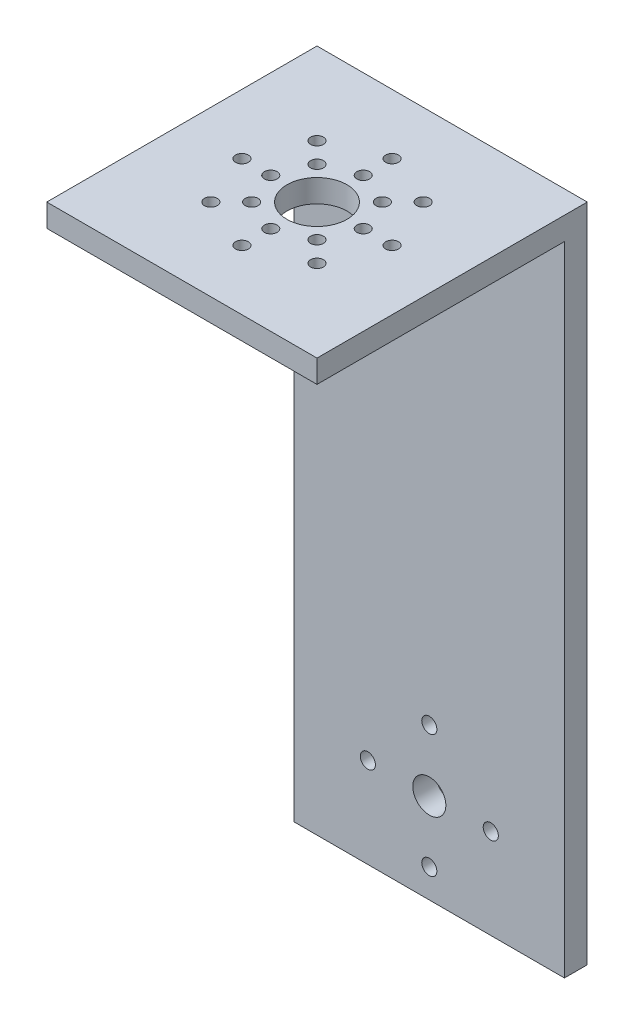
ISO-10303-21;
HEADER;
FILE_DESCRIPTION(('STEP AP214'),'2;1');
FILE_NAME('part.step','',(''),(''),'','','');
FILE_SCHEMA(('AUTOMOTIVE_DESIGN { 1 0 10303 214 1 1 1 1 }'));
ENDSEC;
DATA;
#1=APPLICATION_CONTEXT('core data for automotive mechanical design processes');
#2=APPLICATION_PROTOCOL_DEFINITION('international standard','automotive_design',2000,#1);
#3=PRODUCT_CONTEXT('',#1,'mechanical');
#4=PRODUCT('Part','Part','',(#3));
#5=PRODUCT_RELATED_PRODUCT_CATEGORY('part','',(#4));
#6=PRODUCT_DEFINITION_FORMATION('','',#4);
#7=PRODUCT_DEFINITION_CONTEXT('part definition',#1,'design');
#8=PRODUCT_DEFINITION('design','',#6,#7);
#9=PRODUCT_DEFINITION_SHAPE('','',#8);
#10=(LENGTH_UNIT() NAMED_UNIT(*) SI_UNIT(.MILLI.,.METRE.));
#11=(NAMED_UNIT(*) PLANE_ANGLE_UNIT() SI_UNIT($,.RADIAN.));
#12=(NAMED_UNIT(*) SI_UNIT($,.STERADIAN.) SOLID_ANGLE_UNIT());
#13=UNCERTAINTY_MEASURE_WITH_UNIT(LENGTH_MEASURE(1.E-05),#10,'distance_accuracy_value','');
#14=(GEOMETRIC_REPRESENTATION_CONTEXT(3) GLOBAL_UNCERTAINTY_ASSIGNED_CONTEXT((#13)) GLOBAL_UNIT_ASSIGNED_CONTEXT((#10,
#11,#12)) REPRESENTATION_CONTEXT('',''));
#15=CARTESIAN_POINT('',(0.,0.,0.));
#16=DIRECTION('',(0.,0.,1.));
#17=DIRECTION('',(1.,0.,0.));
#18=AXIS2_PLACEMENT_3D('',#15,#16,#17);
#19=CARTESIAN_POINT('',(57.15,0.,-52.324));
#20=DIRECTION('',(0.,0.,-1.));
#21=DIRECTION('',(0.,1.,0.));
#22=AXIS2_PLACEMENT_3D('',#19,#20,#21);
#23=PLANE('',#22);
#24=CARTESIAN_POINT('',(41.575,-120.65,-52.324));
#25=DIRECTION('',(0.,0.,-1.));
#26=DIRECTION('',(1.,0.,0.));
#27=AXIS2_PLACEMENT_3D('',#24,#25,#26);
#28=CIRCLE('',#27,1.6);
#29=CARTESIAN_POINT('',(43.175,-120.65,-52.324));
#30=VERTEX_POINT('',#29);
#31=EDGE_CURVE('E164',#30,#30,#28,.T.);
#32=ORIENTED_EDGE('',*,*,#31,.T.);
#33=EDGE_LOOP('',(#32));
#34=FACE_BOUND('',#33,.T.);
#35=CARTESIAN_POINT('',(28.575,-133.65,-52.324));
#36=DIRECTION('',(0.,0.,-1.));
#37=DIRECTION('',(0.,-1.,0.));
#38=AXIS2_PLACEMENT_3D('',#35,#36,#37);
#39=CIRCLE('',#38,1.6);
#40=CARTESIAN_POINT('',(28.575,-135.25,-52.324));
#41=VERTEX_POINT('',#40);
#42=EDGE_CURVE('E168',#41,#41,#39,.T.);
#43=ORIENTED_EDGE('',*,*,#42,.T.);
#44=EDGE_LOOP('',(#43));
#45=FACE_BOUND('',#44,.T.);
#46=CARTESIAN_POINT('',(15.575,-120.65,-52.324));
#47=DIRECTION('',(0.,0.,-1.));
#48=DIRECTION('',(-1.,0.,0.));
#49=AXIS2_PLACEMENT_3D('',#46,#47,#48);
#50=CIRCLE('',#49,1.6);
#51=CARTESIAN_POINT('',(13.975,-120.65,-52.324));
#52=VERTEX_POINT('',#51);
#53=EDGE_CURVE('E172',#52,#52,#50,.T.);
#54=ORIENTED_EDGE('',*,*,#53,.T.);
#55=EDGE_LOOP('',(#54));
#56=FACE_BOUND('',#55,.T.);
#57=CARTESIAN_POINT('',(28.575,-107.65,-52.324));
#58=DIRECTION('',(0.,0.,-1.));
#59=DIRECTION('',(0.,1.,0.));
#60=AXIS2_PLACEMENT_3D('',#57,#58,#59);
#61=CIRCLE('',#60,1.6);
#62=CARTESIAN_POINT('',(28.575,-106.05,-52.324));
#63=VERTEX_POINT('',#62);
#64=EDGE_CURVE('E176',#63,#63,#61,.T.);
#65=ORIENTED_EDGE('',*,*,#64,.T.);
#66=EDGE_LOOP('',(#65));
#67=FACE_BOUND('',#66,.T.);
#68=CARTESIAN_POINT('',(28.575,-120.65,-52.324));
#69=DIRECTION('',(0.,0.,-1.));
#70=DIRECTION('',(0.,1.,0.));
#71=AXIS2_PLACEMENT_3D('',#68,#69,#70);
#72=CIRCLE('',#71,3.5);
#73=CARTESIAN_POINT('',(28.575,-117.15,-52.324));
#74=VERTEX_POINT('',#73);
#75=EDGE_CURVE('E179',#74,#74,#72,.F.);
#76=ORIENTED_EDGE('',*,*,#75,.F.);
#77=EDGE_LOOP('',(#76));
#78=FACE_BOUND('',#77,.T.);
#79=DIRECTION('',(0.,-1.,0.));
#80=VECTOR('',#79,1.);
#81=CARTESIAN_POINT('',(0.,0.,-52.324));
#82=LINE('',#81,#80);
#83=CARTESIAN_POINT('',(0.,-4.826,-52.324));
#84=VERTEX_POINT('',#83);
#85=CARTESIAN_POINT('',(0.,-139.7,-52.324));
#86=VERTEX_POINT('',#85);
#87=EDGE_CURVE('E116',#84,#86,#82,.T.);
#88=ORIENTED_EDGE('',*,*,#87,.T.);
#89=DIRECTION('',(-1.,0.,0.));
#90=VECTOR('',#89,1.);
#91=CARTESIAN_POINT('',(57.15,-139.7,-52.324));
#92=LINE('',#91,#90);
#93=CARTESIAN_POINT('',(57.15,-139.7,-52.324));
#94=VERTEX_POINT('',#93);
#95=EDGE_CURVE('E11',#94,#86,#92,.T.);
#96=ORIENTED_EDGE('',*,*,#95,.F.);
#97=DIRECTION('',(0.,-1.,0.));
#98=VECTOR('',#97,1.);
#99=CARTESIAN_POINT('',(57.15,0.,-52.324));
#100=LINE('',#99,#98);
#101=CARTESIAN_POINT('',(57.15,-4.826,-52.324));
#102=VERTEX_POINT('',#101);
#103=EDGE_CURVE('E81',#102,#94,#100,.T.);
#104=ORIENTED_EDGE('',*,*,#103,.F.);
#105=DIRECTION('',(-1.,0.,0.));
#106=VECTOR('',#105,1.);
#107=CARTESIAN_POINT('',(57.15,-4.826,-52.324));
#108=LINE('',#107,#106);
#109=EDGE_CURVE('E112',#102,#84,#108,.T.);
#110=ORIENTED_EDGE('',*,*,#109,.T.);
#111=EDGE_LOOP('',(#88,#96,#104,#110));
#112=FACE_BOUND('',#111,.T.);
#113=ADVANCED_FACE('F35',(#34,#45,#56,#67,#78,#112),#23,.F.);
#114=CARTESIAN_POINT('',(57.15,-139.7,-57.15));
#115=DIRECTION('',(0.,-1.,0.));
#116=DIRECTION('',(0.,0.,-1.));
#117=AXIS2_PLACEMENT_3D('',#114,#115,#116);
#118=PLANE('',#117);
#119=DIRECTION('',(0.,0.,1.));
#120=VECTOR('',#119,1.);
#121=CARTESIAN_POINT('',(0.,-139.7,-57.15));
#122=LINE('',#121,#120);
#123=CARTESIAN_POINT('',(0.,-139.7,-57.15));
#124=VERTEX_POINT('',#123);
#125=EDGE_CURVE('E119',#124,#86,#122,.T.);
#126=ORIENTED_EDGE('',*,*,#125,.F.);
#127=DIRECTION('',(-1.,0.,0.));
#128=VECTOR('',#127,1.);
#129=CARTESIAN_POINT('',(57.15,-139.7,-57.15));
#130=LINE('',#129,#128);
#131=CARTESIAN_POINT('',(57.15,-139.7,-57.15));
#132=VERTEX_POINT('',#131);
#133=EDGE_CURVE('E43',#132,#124,#130,.T.);
#134=ORIENTED_EDGE('',*,*,#133,.F.);
#135=DIRECTION('',(0.,0.,1.));
#136=VECTOR('',#135,1.);
#137=CARTESIAN_POINT('',(57.15,-139.7,-57.15));
#138=LINE('',#137,#136);
#139=EDGE_CURVE('E288',#132,#94,#138,.T.);
#140=ORIENTED_EDGE('',*,*,#139,.T.);
#141=ORIENTED_EDGE('',*,*,#95,.T.);
#142=EDGE_LOOP('',(#126,#134,#140,#141));
#143=FACE_BOUND('',#142,.T.);
#144=ADVANCED_FACE('F138',(#143),#118,.T.);
#145=CARTESIAN_POINT('',(57.15,0.,-57.15));
#146=DIRECTION('',(0.,0.,-1.));
#147=DIRECTION('',(0.,1.,0.));
#148=AXIS2_PLACEMENT_3D('',#145,#146,#147);
#149=PLANE('',#148);
#150=CARTESIAN_POINT('',(41.575,-120.65,-57.15));
#151=DIRECTION('',(0.,0.,-1.));
#152=DIRECTION('',(1.,0.,0.));
#153=AXIS2_PLACEMENT_3D('',#150,#151,#152);
#154=CIRCLE('',#153,1.6);
#155=CARTESIAN_POINT('',(43.175,-120.65,-57.15));
#156=VERTEX_POINT('',#155);
#157=EDGE_CURVE('E388',#156,#156,#154,.T.);
#158=ORIENTED_EDGE('',*,*,#157,.F.);
#159=EDGE_LOOP('',(#158));
#160=FACE_BOUND('',#159,.T.);
#161=CARTESIAN_POINT('',(28.575,-133.65,-57.15));
#162=DIRECTION('',(0.,0.,-1.));
#163=DIRECTION('',(0.,-1.,0.));
#164=AXIS2_PLACEMENT_3D('',#161,#162,#163);
#165=CIRCLE('',#164,1.6);
#166=CARTESIAN_POINT('',(28.575,-135.25,-57.15));
#167=VERTEX_POINT('',#166);
#168=EDGE_CURVE('E395',#167,#167,#165,.T.);
#169=ORIENTED_EDGE('',*,*,#168,.F.);
#170=EDGE_LOOP('',(#169));
#171=FACE_BOUND('',#170,.T.);
#172=CARTESIAN_POINT('',(15.575,-120.65,-57.15));
#173=DIRECTION('',(0.,0.,-1.));
#174=DIRECTION('',(-1.,0.,0.));
#175=AXIS2_PLACEMENT_3D('',#172,#173,#174);
#176=CIRCLE('',#175,1.6);
#177=CARTESIAN_POINT('',(13.975,-120.65,-57.15));
#178=VERTEX_POINT('',#177);
#179=EDGE_CURVE('E399',#178,#178,#176,.T.);
#180=ORIENTED_EDGE('',*,*,#179,.F.);
#181=EDGE_LOOP('',(#180));
#182=FACE_BOUND('',#181,.T.);
#183=CARTESIAN_POINT('',(28.575,-107.65,-57.15));
#184=DIRECTION('',(0.,0.,-1.));
#185=DIRECTION('',(0.,1.,0.));
#186=AXIS2_PLACEMENT_3D('',#183,#184,#185);
#187=CIRCLE('',#186,1.6);
#188=CARTESIAN_POINT('',(28.575,-106.05,-57.15));
#189=VERTEX_POINT('',#188);
#190=EDGE_CURVE('E389',#189,#189,#187,.T.);
#191=ORIENTED_EDGE('',*,*,#190,.F.);
#192=EDGE_LOOP('',(#191));
#193=FACE_BOUND('',#192,.T.);
#194=CARTESIAN_POINT('',(28.575,-120.65,-57.15));
#195=DIRECTION('',(0.,0.,-1.));
#196=DIRECTION('',(0.,1.,0.));
#197=AXIS2_PLACEMENT_3D('',#194,#195,#196);
#198=CIRCLE('',#197,3.5);
#199=CARTESIAN_POINT('',(28.575,-117.15,-57.15));
#200=VERTEX_POINT('',#199);
#201=EDGE_CURVE('E182',#200,#200,#198,.T.);
#202=ORIENTED_EDGE('',*,*,#201,.F.);
#203=EDGE_LOOP('',(#202));
#204=FACE_BOUND('',#203,.T.);
#205=DIRECTION('',(0.,-1.,0.));
#206=VECTOR('',#205,1.);
#207=CARTESIAN_POINT('',(0.,0.,-57.15));
#208=LINE('',#207,#206);
#209=CARTESIAN_POINT('',(0.,0.,-57.15));
#210=VERTEX_POINT('',#209);
#211=EDGE_CURVE('E123',#210,#124,#208,.T.);
#212=ORIENTED_EDGE('',*,*,#211,.F.);
#213=DIRECTION('',(-1.,0.,0.));
#214=VECTOR('',#213,1.);
#215=CARTESIAN_POINT('',(57.15,0.,-57.15));
#216=LINE('',#215,#214);
#217=CARTESIAN_POINT('',(57.15,0.,-57.15));
#218=VERTEX_POINT('',#217);
#219=EDGE_CURVE('E102',#218,#210,#216,.T.);
#220=ORIENTED_EDGE('',*,*,#219,.F.);
#221=DIRECTION('',(0.,-1.,0.));
#222=VECTOR('',#221,1.);
#223=CARTESIAN_POINT('',(57.15,0.,-57.15));
#224=LINE('',#223,#222);
#225=EDGE_CURVE('E108',#218,#132,#224,.T.);
#226=ORIENTED_EDGE('',*,*,#225,.T.);
#227=ORIENTED_EDGE('',*,*,#133,.T.);
#228=EDGE_LOOP('',(#212,#220,#226,#227));
#229=FACE_BOUND('',#228,.T.);
#230=ADVANCED_FACE('F135',(#160,#171,#182,#193,#204,#229),#149,.T.);
#231=CARTESIAN_POINT('',(57.15,0.,0.));
#232=DIRECTION('',(0.,1.,0.));
#233=DIRECTION('',(0.,0.,1.));
#234=AXIS2_PLACEMENT_3D('',#231,#232,#233);
#235=PLANE('',#234);
#236=CARTESIAN_POINT('',(18.796,0.,-28.575));
#237=DIRECTION('',(0.,1.,0.));
#238=DIRECTION('',(0.707106781186549,0.,0.707106781186546));
#239=AXIS2_PLACEMENT_3D('',#236,#237,#238);
#240=CIRCLE('',#239,1.35254999999999);
#241=CARTESIAN_POINT('',(19.7523972768939,0.,-27.6186027231061));
#242=VERTEX_POINT('',#241);
#243=EDGE_CURVE('E191',#242,#242,#240,.T.);
#244=ORIENTED_EDGE('',*,*,#243,.F.);
#245=EDGE_LOOP('',(#244));
#246=FACE_BOUND('',#245,.T.);
#247=CARTESIAN_POINT('',(21.6602027867768,0.,-21.6602027867767));
#248=DIRECTION('',(0.,1.,0.));
#249=DIRECTION('',(1.,0.,0.));
#250=AXIS2_PLACEMENT_3D('',#247,#248,#249);
#251=CIRCLE('',#250,1.35254999999999);
#252=CARTESIAN_POINT('',(23.0127527867768,0.,-21.6602027867767));
#253=VERTEX_POINT('',#252);
#254=EDGE_CURVE('E198',#253,#253,#251,.T.);
#255=ORIENTED_EDGE('',*,*,#254,.F.);
#256=EDGE_LOOP('',(#255));
#257=FACE_BOUND('',#256,.T.);
#258=CARTESIAN_POINT('',(28.5750000000001,0.,-18.796));
#259=DIRECTION('',(0.,1.,0.));
#260=DIRECTION('',(0.707106781186544,0.,-0.707106781186551));
#261=AXIS2_PLACEMENT_3D('',#258,#259,#260);
#262=CIRCLE('',#261,1.35254999999999);
#263=CARTESIAN_POINT('',(29.5313972768939,0.,-19.7523972768939));
#264=VERTEX_POINT('',#263);
#265=EDGE_CURVE('E204',#264,#264,#262,.T.);
#266=ORIENTED_EDGE('',*,*,#265,.F.);
#267=EDGE_LOOP('',(#266));
#268=FACE_BOUND('',#267,.T.);
#269=CARTESIAN_POINT('',(35.4897972132233,0.,-21.6602027867768));
#270=DIRECTION('',(0.,1.,0.));
#271=DIRECTION('',(0.,0.,-1.));
#272=AXIS2_PLACEMENT_3D('',#269,#270,#271);
#273=CIRCLE('',#272,1.35254999999999);
#274=CARTESIAN_POINT('',(35.4897972132233,0.,-23.0127527867767));
#275=VERTEX_POINT('',#274);
#276=EDGE_CURVE('E210',#275,#275,#273,.T.);
#277=ORIENTED_EDGE('',*,*,#276,.F.);
#278=EDGE_LOOP('',(#277));
#279=FACE_BOUND('',#278,.T.);
#280=CARTESIAN_POINT('',(38.354,0.,-28.5750000000001));
#281=DIRECTION('',(0.,1.,0.));
#282=DIRECTION('',(-0.707106781186554,0.,-0.707106781186541));
#283=AXIS2_PLACEMENT_3D('',#280,#281,#282);
#284=CIRCLE('',#283,1.35254999999999);
#285=CARTESIAN_POINT('',(37.3976027231061,0.,-29.5313972768939));
#286=VERTEX_POINT('',#285);
#287=EDGE_CURVE('E216',#286,#286,#284,.T.);
#288=ORIENTED_EDGE('',*,*,#287,.F.);
#289=EDGE_LOOP('',(#288));
#290=FACE_BOUND('',#289,.T.);
#291=CARTESIAN_POINT('',(35.4897972132232,0.,-35.4897972132233));
#292=DIRECTION('',(0.,1.,0.));
#293=DIRECTION('',(-1.,0.,0.));
#294=AXIS2_PLACEMENT_3D('',#291,#292,#293);
#295=CIRCLE('',#294,1.35254999999999);
#296=CARTESIAN_POINT('',(34.1372472132232,0.,-35.4897972132233));
#297=VERTEX_POINT('',#296);
#298=EDGE_CURVE('E222',#297,#297,#295,.T.);
#299=ORIENTED_EDGE('',*,*,#298,.F.);
#300=EDGE_LOOP('',(#299));
#301=FACE_BOUND('',#300,.T.);
#302=CARTESIAN_POINT('',(28.5749999999999,0.,-38.354));
#303=DIRECTION('',(0.,1.,0.));
#304=DIRECTION('',(-0.707106781186539,0.,0.707106781186556));
#305=AXIS2_PLACEMENT_3D('',#302,#303,#304);
#306=CIRCLE('',#305,1.35254999999999);
#307=CARTESIAN_POINT('',(27.618602723106,0.,-37.3976027231061));
#308=VERTEX_POINT('',#307);
#309=EDGE_CURVE('E181',#308,#308,#306,.T.);
#310=ORIENTED_EDGE('',*,*,#309,.F.);
#311=EDGE_LOOP('',(#310));
#312=FACE_BOUND('',#311,.T.);
#313=CARTESIAN_POINT('',(12.7,0.,-28.575));
#314=DIRECTION('',(0.,1.,0.));
#315=DIRECTION('',(0.707106781186549,0.,0.707106781186546));
#316=AXIS2_PLACEMENT_3D('',#313,#314,#315);
#317=CIRCLE('',#316,1.35254999999999);
#318=CARTESIAN_POINT('',(13.6563972768939,0.,-27.6186027231061));
#319=VERTEX_POINT('',#318);
#320=EDGE_CURVE('E229',#319,#319,#317,.T.);
#321=ORIENTED_EDGE('',*,*,#320,.F.);
#322=EDGE_LOOP('',(#321));
#323=FACE_BOUND('',#322,.T.);
#324=CARTESIAN_POINT('',(17.3496798486636,0.,-17.3496798486635));
#325=DIRECTION('',(0.,1.,0.));
#326=DIRECTION('',(1.,0.,0.));
#327=AXIS2_PLACEMENT_3D('',#324,#325,#326);
#328=CIRCLE('',#327,1.35254999999999);
#329=CARTESIAN_POINT('',(18.7022298486636,0.,-17.3496798486635));
#330=VERTEX_POINT('',#329);
#331=EDGE_CURVE('E237',#330,#330,#328,.T.);
#332=ORIENTED_EDGE('',*,*,#331,.F.);
#333=EDGE_LOOP('',(#332));
#334=FACE_BOUND('',#333,.T.);
#335=CARTESIAN_POINT('',(28.5750000000001,0.,-12.7));
#336=DIRECTION('',(0.,1.,0.));
#337=DIRECTION('',(0.707106781186544,0.,-0.707106781186551));
#338=AXIS2_PLACEMENT_3D('',#335,#336,#337);
#339=CIRCLE('',#338,1.35254999999999);
#340=CARTESIAN_POINT('',(29.5313972768939,0.,-13.6563972768939));
#341=VERTEX_POINT('',#340);
#342=EDGE_CURVE('E243',#341,#341,#339,.T.);
#343=ORIENTED_EDGE('',*,*,#342,.F.);
#344=EDGE_LOOP('',(#343));
#345=FACE_BOUND('',#344,.T.);
#346=CARTESIAN_POINT('',(39.8003201513365,0.,-17.3496798486636));
#347=DIRECTION('',(0.,1.,0.));
#348=DIRECTION('',(0.,0.,-1.));
#349=AXIS2_PLACEMENT_3D('',#346,#347,#348);
#350=CIRCLE('',#349,1.35254999999999);
#351=CARTESIAN_POINT('',(39.8003201513365,0.,-18.7022298486636));
#352=VERTEX_POINT('',#351);
#353=EDGE_CURVE('E249',#352,#352,#350,.T.);
#354=ORIENTED_EDGE('',*,*,#353,.F.);
#355=EDGE_LOOP('',(#354));
#356=FACE_BOUND('',#355,.T.);
#357=CARTESIAN_POINT('',(44.45,0.,-28.5750000000001));
#358=DIRECTION('',(0.,1.,0.));
#359=DIRECTION('',(-0.707106781186554,0.,-0.707106781186541));
#360=AXIS2_PLACEMENT_3D('',#357,#358,#359);
#361=CIRCLE('',#360,1.35254999999999);
#362=CARTESIAN_POINT('',(43.4936027231061,0.,-29.531397276894));
#363=VERTEX_POINT('',#362);
#364=EDGE_CURVE('E255',#363,#363,#361,.T.);
#365=ORIENTED_EDGE('',*,*,#364,.F.);
#366=EDGE_LOOP('',(#365));
#367=FACE_BOUND('',#366,.T.);
#368=CARTESIAN_POINT('',(39.8003201513363,0.,-39.8003201513366));
#369=DIRECTION('',(0.,1.,0.));
#370=DIRECTION('',(-1.,0.,0.));
#371=AXIS2_PLACEMENT_3D('',#368,#369,#370);
#372=CIRCLE('',#371,1.35254999999999);
#373=CARTESIAN_POINT('',(38.4477701513363,0.,-39.8003201513366));
#374=VERTEX_POINT('',#373);
#375=EDGE_CURVE('E261',#374,#374,#372,.T.);
#376=ORIENTED_EDGE('',*,*,#375,.F.);
#377=EDGE_LOOP('',(#376));
#378=FACE_BOUND('',#377,.T.);
#379=CARTESIAN_POINT('',(28.5749999999998,0.,-44.45));
#380=DIRECTION('',(0.,1.,0.));
#381=DIRECTION('',(-0.707106781186539,0.,0.707106781186556));
#382=AXIS2_PLACEMENT_3D('',#379,#380,#381);
#383=CIRCLE('',#382,1.35254999999999);
#384=CARTESIAN_POINT('',(27.618602723106,0.,-43.4936027231061));
#385=VERTEX_POINT('',#384);
#386=EDGE_CURVE('E197',#385,#385,#383,.T.);
#387=ORIENTED_EDGE('',*,*,#386,.F.);
#388=EDGE_LOOP('',(#387));
#389=FACE_BOUND('',#388,.T.);
#390=CARTESIAN_POINT('',(28.575,0.,-28.575));
#391=DIRECTION('',(0.,1.,0.));
#392=DIRECTION('',(0.,0.,1.));
#393=AXIS2_PLACEMENT_3D('',#390,#391,#392);
#394=CIRCLE('',#393,6.35);
#395=CARTESIAN_POINT('',(28.575,0.,-22.225));
#396=VERTEX_POINT('',#395);
#397=EDGE_CURVE('E236',#396,#396,#394,.T.);
#398=ORIENTED_EDGE('',*,*,#397,.F.);
#399=EDGE_LOOP('',(#398));
#400=FACE_BOUND('',#399,.T.);
#401=CARTESIAN_POINT('',(17.3496798486636,0.,-39.8003201513364));
#402=DIRECTION('',(0.,1.,0.));
#403=DIRECTION('',(0.,0.,1.));
#404=AXIS2_PLACEMENT_3D('',#401,#402,#403);
#405=CIRCLE('',#404,1.35254999999999);
#406=CARTESIAN_POINT('',(17.3496798486636,0.,-38.4477701513364));
#407=VERTEX_POINT('',#406);
#408=EDGE_CURVE('E276',#407,#407,#405,.T.);
#409=ORIENTED_EDGE('',*,*,#408,.F.);
#410=EDGE_LOOP('',(#409));
#411=FACE_BOUND('',#410,.T.);
#412=CARTESIAN_POINT('',(21.6602027867768,0.,-35.4897972132232));
#413=DIRECTION('',(0.,1.,0.));
#414=DIRECTION('',(0.,0.,1.));
#415=AXIS2_PLACEMENT_3D('',#412,#413,#414);
#416=CIRCLE('',#415,1.35254999999999);
#417=CARTESIAN_POINT('',(21.6602027867768,0.,-34.1372472132233));
#418=VERTEX_POINT('',#417);
#419=EDGE_CURVE('E282',#418,#418,#416,.T.);
#420=ORIENTED_EDGE('',*,*,#419,.F.);
#421=EDGE_LOOP('',(#420));
#422=FACE_BOUND('',#421,.T.);
#423=DIRECTION('',(0.,0.,-1.));
#424=VECTOR('',#423,1.);
#425=CARTESIAN_POINT('',(0.,0.,0.));
#426=LINE('',#425,#424);
#427=CARTESIAN_POINT('',(0.,0.,0.));
#428=VERTEX_POINT('',#427);
#429=EDGE_CURVE('E97',#428,#210,#426,.T.);
#430=ORIENTED_EDGE('',*,*,#429,.F.);
#431=DIRECTION('',(-1.,0.,0.));
#432=VECTOR('',#431,1.);
#433=CARTESIAN_POINT('',(57.15,0.,0.));
#434=LINE('',#433,#432);
#435=CARTESIAN_POINT('',(57.15,0.,0.));
#436=VERTEX_POINT('',#435);
#437=EDGE_CURVE('E92',#436,#428,#434,.T.);
#438=ORIENTED_EDGE('',*,*,#437,.F.);
#439=DIRECTION('',(0.,0.,-1.));
#440=VECTOR('',#439,1.);
#441=CARTESIAN_POINT('',(57.15,0.,0.));
#442=LINE('',#441,#440);
#443=EDGE_CURVE('E95',#436,#218,#442,.T.);
#444=ORIENTED_EDGE('',*,*,#443,.T.);
#445=ORIENTED_EDGE('',*,*,#219,.T.);
#446=EDGE_LOOP('',(#430,#438,#444,#445));
#447=FACE_BOUND('',#446,.T.);
#448=ADVANCED_FACE('F94',(#246,#257,#268,#279,#290,#301,#312,#323,#334,#345,#356,#367,#378,#389,
#400,#411,#422,#447),#235,.T.);
#449=CARTESIAN_POINT('',(57.15,-4.826,0.));
#450=DIRECTION('',(0.,0.,1.));
#451=DIRECTION('',(1.,0.,0.));
#452=AXIS2_PLACEMENT_3D('',#449,#450,#451);
#453=PLANE('',#452);
#454=DIRECTION('',(0.,1.,0.));
#455=VECTOR('',#454,1.);
#456=CARTESIAN_POINT('',(0.,-4.826,0.));
#457=LINE('',#456,#455);
#458=CARTESIAN_POINT('',(0.,-4.826,0.));
#459=VERTEX_POINT('',#458);
#460=EDGE_CURVE('E127',#459,#428,#457,.T.);
#461=ORIENTED_EDGE('',*,*,#460,.F.);
#462=DIRECTION('',(-1.,0.,0.));
#463=VECTOR('',#462,1.);
#464=CARTESIAN_POINT('',(57.15,-4.826,0.));
#465=LINE('',#464,#463);
#466=CARTESIAN_POINT('',(57.15,-4.826,0.));
#467=VERTEX_POINT('',#466);
#468=EDGE_CURVE('E72',#467,#459,#465,.T.);
#469=ORIENTED_EDGE('',*,*,#468,.F.);
#470=DIRECTION('',(0.,1.,0.));
#471=VECTOR('',#470,1.);
#472=CARTESIAN_POINT('',(57.15,-4.826,0.));
#473=LINE('',#472,#471);
#474=EDGE_CURVE('E106',#467,#436,#473,.T.);
#475=ORIENTED_EDGE('',*,*,#474,.T.);
#476=ORIENTED_EDGE('',*,*,#437,.T.);
#477=EDGE_LOOP('',(#461,#469,#475,#476));
#478=FACE_BOUND('',#477,.T.);
#479=ADVANCED_FACE('F110',(#478),#453,.T.);
#480=CARTESIAN_POINT('',(57.15,-4.826,0.));
#481=DIRECTION('',(0.,1.,0.));
#482=DIRECTION('',(0.,0.,1.));
#483=AXIS2_PLACEMENT_3D('',#480,#481,#482);
#484=PLANE('',#483);
#485=CARTESIAN_POINT('',(18.796,-4.826,-28.575));
#486=DIRECTION('',(0.,1.,0.));
#487=DIRECTION('',(0.707106781186549,0.,0.707106781186546));
#488=AXIS2_PLACEMENT_3D('',#485,#486,#487);
#489=CIRCLE('',#488,1.35254999999999);
#490=CARTESIAN_POINT('',(19.7523972768939,-4.826,-27.6186027231061));
#491=VERTEX_POINT('',#490);
#492=EDGE_CURVE('E194',#491,#491,#489,.T.);
#493=ORIENTED_EDGE('',*,*,#492,.T.);
#494=EDGE_LOOP('',(#493));
#495=FACE_BOUND('',#494,.T.);
#496=CARTESIAN_POINT('',(21.6602027867768,-4.826,-21.6602027867767));
#497=DIRECTION('',(0.,1.,0.));
#498=DIRECTION('',(1.,0.,0.));
#499=AXIS2_PLACEMENT_3D('',#496,#497,#498);
#500=CIRCLE('',#499,1.35254999999999);
#501=CARTESIAN_POINT('',(23.0127527867768,-4.826,-21.6602027867767));
#502=VERTEX_POINT('',#501);
#503=EDGE_CURVE('E195',#502,#502,#500,.T.);
#504=ORIENTED_EDGE('',*,*,#503,.T.);
#505=EDGE_LOOP('',(#504));
#506=FACE_BOUND('',#505,.T.);
#507=CARTESIAN_POINT('',(28.5750000000001,-4.826,-18.796));
#508=DIRECTION('',(0.,1.,0.));
#509=DIRECTION('',(0.707106781186544,0.,-0.707106781186551));
#510=AXIS2_PLACEMENT_3D('',#507,#508,#509);
#511=CIRCLE('',#510,1.35254999999999);
#512=CARTESIAN_POINT('',(29.5313972768939,-4.826,-19.7523972768939));
#513=VERTEX_POINT('',#512);
#514=EDGE_CURVE('E201',#513,#513,#511,.T.);
#515=ORIENTED_EDGE('',*,*,#514,.T.);
#516=EDGE_LOOP('',(#515));
#517=FACE_BOUND('',#516,.T.);
#518=CARTESIAN_POINT('',(35.4897972132233,-4.826,-21.6602027867768));
#519=DIRECTION('',(0.,1.,0.));
#520=DIRECTION('',(0.,0.,-1.));
#521=AXIS2_PLACEMENT_3D('',#518,#519,#520);
#522=CIRCLE('',#521,1.35254999999999);
#523=CARTESIAN_POINT('',(35.4897972132233,-4.826,-23.0127527867767));
#524=VERTEX_POINT('',#523);
#525=EDGE_CURVE('E207',#524,#524,#522,.T.);
#526=ORIENTED_EDGE('',*,*,#525,.T.);
#527=EDGE_LOOP('',(#526));
#528=FACE_BOUND('',#527,.T.);
#529=CARTESIAN_POINT('',(38.354,-4.826,-28.5750000000001));
#530=DIRECTION('',(0.,1.,0.));
#531=DIRECTION('',(-0.707106781186554,0.,-0.707106781186541));
#532=AXIS2_PLACEMENT_3D('',#529,#530,#531);
#533=CIRCLE('',#532,1.35254999999999);
#534=CARTESIAN_POINT('',(37.3976027231061,-4.826,-29.5313972768939));
#535=VERTEX_POINT('',#534);
#536=EDGE_CURVE('E213',#535,#535,#533,.T.);
#537=ORIENTED_EDGE('',*,*,#536,.T.);
#538=EDGE_LOOP('',(#537));
#539=FACE_BOUND('',#538,.T.);
#540=CARTESIAN_POINT('',(35.4897972132232,-4.826,-35.4897972132233));
#541=DIRECTION('',(0.,1.,0.));
#542=DIRECTION('',(-1.,0.,0.));
#543=AXIS2_PLACEMENT_3D('',#540,#541,#542);
#544=CIRCLE('',#543,1.35254999999999);
#545=CARTESIAN_POINT('',(34.1372472132232,-4.826,-35.4897972132233));
#546=VERTEX_POINT('',#545);
#547=EDGE_CURVE('E219',#546,#546,#544,.T.);
#548=ORIENTED_EDGE('',*,*,#547,.T.);
#549=EDGE_LOOP('',(#548));
#550=FACE_BOUND('',#549,.T.);
#551=CARTESIAN_POINT('',(28.5749999999999,-4.826,-38.354));
#552=DIRECTION('',(0.,1.,0.));
#553=DIRECTION('',(-0.707106781186539,0.,0.707106781186556));
#554=AXIS2_PLACEMENT_3D('',#551,#552,#553);
#555=CIRCLE('',#554,1.35254999999999);
#556=CARTESIAN_POINT('',(27.618602723106,-4.826,-37.3976027231061));
#557=VERTEX_POINT('',#556);
#558=EDGE_CURVE('E185',#557,#557,#555,.T.);
#559=ORIENTED_EDGE('',*,*,#558,.T.);
#560=EDGE_LOOP('',(#559));
#561=FACE_BOUND('',#560,.T.);
#562=CARTESIAN_POINT('',(12.7,-4.826,-28.575));
#563=DIRECTION('',(0.,1.,0.));
#564=DIRECTION('',(0.707106781186549,0.,0.707106781186546));
#565=AXIS2_PLACEMENT_3D('',#562,#563,#564);
#566=CIRCLE('',#565,1.35254999999999);
#567=CARTESIAN_POINT('',(13.6563972768939,-4.826,-27.6186027231061));
#568=VERTEX_POINT('',#567);
#569=EDGE_CURVE('E232',#568,#568,#566,.T.);
#570=ORIENTED_EDGE('',*,*,#569,.T.);
#571=EDGE_LOOP('',(#570));
#572=FACE_BOUND('',#571,.T.);
#573=CARTESIAN_POINT('',(17.3496798486636,-4.826,-17.3496798486635));
#574=DIRECTION('',(0.,1.,0.));
#575=DIRECTION('',(1.,0.,0.));
#576=AXIS2_PLACEMENT_3D('',#573,#574,#575);
#577=CIRCLE('',#576,1.35254999999999);
#578=CARTESIAN_POINT('',(18.7022298486636,-4.826,-17.3496798486635));
#579=VERTEX_POINT('',#578);
#580=EDGE_CURVE('E233',#579,#579,#577,.T.);
#581=ORIENTED_EDGE('',*,*,#580,.T.);
#582=EDGE_LOOP('',(#581));
#583=FACE_BOUND('',#582,.T.);
#584=CARTESIAN_POINT('',(28.5750000000001,-4.826,-12.7));
#585=DIRECTION('',(0.,1.,0.));
#586=DIRECTION('',(0.707106781186544,0.,-0.707106781186551));
#587=AXIS2_PLACEMENT_3D('',#584,#585,#586);
#588=CIRCLE('',#587,1.35254999999999);
#589=CARTESIAN_POINT('',(29.5313972768939,-4.826,-13.6563972768939));
#590=VERTEX_POINT('',#589);
#591=EDGE_CURVE('E240',#590,#590,#588,.T.);
#592=ORIENTED_EDGE('',*,*,#591,.T.);
#593=EDGE_LOOP('',(#592));
#594=FACE_BOUND('',#593,.T.);
#595=CARTESIAN_POINT('',(39.8003201513365,-4.826,-17.3496798486636));
#596=DIRECTION('',(0.,1.,0.));
#597=DIRECTION('',(0.,0.,-1.));
#598=AXIS2_PLACEMENT_3D('',#595,#596,#597);
#599=CIRCLE('',#598,1.35254999999999);
#600=CARTESIAN_POINT('',(39.8003201513365,-4.826,-18.7022298486636));
#601=VERTEX_POINT('',#600);
#602=EDGE_CURVE('E246',#601,#601,#599,.T.);
#603=ORIENTED_EDGE('',*,*,#602,.T.);
#604=EDGE_LOOP('',(#603));
#605=FACE_BOUND('',#604,.T.);
#606=CARTESIAN_POINT('',(44.45,-4.826,-28.5750000000001));
#607=DIRECTION('',(0.,1.,0.));
#608=DIRECTION('',(-0.707106781186554,0.,-0.707106781186541));
#609=AXIS2_PLACEMENT_3D('',#606,#607,#608);
#610=CIRCLE('',#609,1.35254999999999);
#611=CARTESIAN_POINT('',(43.4936027231061,-4.826,-29.531397276894));
#612=VERTEX_POINT('',#611);
#613=EDGE_CURVE('E252',#612,#612,#610,.T.);
#614=ORIENTED_EDGE('',*,*,#613,.T.);
#615=EDGE_LOOP('',(#614));
#616=FACE_BOUND('',#615,.T.);
#617=CARTESIAN_POINT('',(39.8003201513363,-4.826,-39.8003201513366));
#618=DIRECTION('',(0.,1.,0.));
#619=DIRECTION('',(-1.,0.,0.));
#620=AXIS2_PLACEMENT_3D('',#617,#618,#619);
#621=CIRCLE('',#620,1.35254999999999);
#622=CARTESIAN_POINT('',(38.4477701513363,-4.826,-39.8003201513366));
#623=VERTEX_POINT('',#622);
#624=EDGE_CURVE('E258',#623,#623,#621,.T.);
#625=ORIENTED_EDGE('',*,*,#624,.T.);
#626=EDGE_LOOP('',(#625));
#627=FACE_BOUND('',#626,.T.);
#628=CARTESIAN_POINT('',(28.5749999999998,-4.826,-44.45));
#629=DIRECTION('',(0.,1.,0.));
#630=DIRECTION('',(-0.707106781186539,0.,0.707106781186556));
#631=AXIS2_PLACEMENT_3D('',#628,#629,#630);
#632=CIRCLE('',#631,1.35254999999999);
#633=CARTESIAN_POINT('',(27.618602723106,-4.826,-43.4936027231061));
#634=VERTEX_POINT('',#633);
#635=EDGE_CURVE('E264',#634,#634,#632,.T.);
#636=ORIENTED_EDGE('',*,*,#635,.T.);
#637=EDGE_LOOP('',(#636));
#638=FACE_BOUND('',#637,.T.);
#639=CARTESIAN_POINT('',(28.575,-4.826,-28.575));
#640=DIRECTION('',(0.,1.,0.));
#641=DIRECTION('',(0.,0.,1.));
#642=AXIS2_PLACEMENT_3D('',#639,#640,#641);
#643=CIRCLE('',#642,6.35);
#644=CARTESIAN_POINT('',(28.575,-4.826,-22.225));
#645=VERTEX_POINT('',#644);
#646=EDGE_CURVE('E273',#645,#645,#643,.F.);
#647=ORIENTED_EDGE('',*,*,#646,.F.);
#648=EDGE_LOOP('',(#647));
#649=FACE_BOUND('',#648,.T.);
#650=CARTESIAN_POINT('',(17.3496798486636,-4.826,-39.8003201513364));
#651=DIRECTION('',(0.,1.,0.));
#652=DIRECTION('',(0.,0.,1.));
#653=AXIS2_PLACEMENT_3D('',#650,#651,#652);
#654=CIRCLE('',#653,1.35254999999999);
#655=CARTESIAN_POINT('',(17.3496798486636,-4.826,-38.4477701513364));
#656=VERTEX_POINT('',#655);
#657=EDGE_CURVE('E279',#656,#656,#654,.T.);
#658=ORIENTED_EDGE('',*,*,#657,.T.);
#659=EDGE_LOOP('',(#658));
#660=FACE_BOUND('',#659,.T.);
#661=CARTESIAN_POINT('',(21.6602027867768,-4.826,-35.4897972132232));
#662=DIRECTION('',(0.,1.,0.));
#663=DIRECTION('',(0.,0.,1.));
#664=AXIS2_PLACEMENT_3D('',#661,#662,#663);
#665=CIRCLE('',#664,1.35254999999999);
#666=CARTESIAN_POINT('',(21.6602027867768,-4.826,-34.1372472132233));
#667=VERTEX_POINT('',#666);
#668=EDGE_CURVE('E120',#667,#667,#665,.T.);
#669=ORIENTED_EDGE('',*,*,#668,.T.);
#670=EDGE_LOOP('',(#669));
#671=FACE_BOUND('',#670,.T.);
#672=DIRECTION('',(0.,0.,-1.));
#673=VECTOR('',#672,1.);
#674=CARTESIAN_POINT('',(0.,-4.826,0.));
#675=LINE('',#674,#673);
#676=EDGE_CURVE('E75',#459,#84,#675,.T.);
#677=ORIENTED_EDGE('',*,*,#676,.T.);
#678=ORIENTED_EDGE('',*,*,#109,.F.);
#679=DIRECTION('',(0.,0.,-1.));
#680=VECTOR('',#679,1.);
#681=CARTESIAN_POINT('',(57.15,-4.826,0.));
#682=LINE('',#681,#680);
#683=EDGE_CURVE('E51',#467,#102,#682,.T.);
#684=ORIENTED_EDGE('',*,*,#683,.F.);
#685=ORIENTED_EDGE('',*,*,#468,.T.);
#686=EDGE_LOOP('',(#677,#678,#684,#685));
#687=FACE_BOUND('',#686,.T.);
#688=ADVANCED_FACE('F143',(#495,#506,#517,#528,#539,#550,#561,#572,#583,#594,#605,#616,#627,
#638,#649,#660,#671,#687),#484,.F.);
#689=CARTESIAN_POINT('',(57.15,0.,0.));
#690=DIRECTION('',(-1.,0.,0.));
#691=DIRECTION('',(0.,0.,1.));
#692=AXIS2_PLACEMENT_3D('',#689,#690,#691);
#693=PLANE('',#692);
#694=ORIENTED_EDGE('',*,*,#103,.T.);
#695=ORIENTED_EDGE('',*,*,#139,.F.);
#696=ORIENTED_EDGE('',*,*,#225,.F.);
#697=ORIENTED_EDGE('',*,*,#443,.F.);
#698=ORIENTED_EDGE('',*,*,#474,.F.);
#699=ORIENTED_EDGE('',*,*,#683,.T.);
#700=EDGE_LOOP('',(#694,#695,#696,#697,#698,#699));
#701=FACE_BOUND('',#700,.T.);
#702=ADVANCED_FACE('F105',(#701),#693,.F.);
#703=CARTESIAN_POINT('',(0.,0.,0.));
#704=DIRECTION('',(-1.,0.,0.));
#705=DIRECTION('',(0.,0.,1.));
#706=AXIS2_PLACEMENT_3D('',#703,#704,#705);
#707=PLANE('',#706);
#708=ORIENTED_EDGE('',*,*,#87,.F.);
#709=ORIENTED_EDGE('',*,*,#676,.F.);
#710=ORIENTED_EDGE('',*,*,#460,.T.);
#711=ORIENTED_EDGE('',*,*,#429,.T.);
#712=ORIENTED_EDGE('',*,*,#211,.T.);
#713=ORIENTED_EDGE('',*,*,#125,.T.);
#714=EDGE_LOOP('',(#708,#709,#710,#711,#712,#713));
#715=FACE_BOUND('',#714,.T.);
#716=ADVANCED_FACE('F141',(#715),#707,.T.);
#717=CARTESIAN_POINT('',(21.6602027867768,0.,-35.4897972132232));
#718=DIRECTION('',(0.,1.,0.));
#719=DIRECTION('',(0.,0.,1.));
#720=AXIS2_PLACEMENT_3D('',#717,#718,#719);
#721=CYLINDRICAL_SURFACE('',#720,1.35254999999999);
#722=ORIENTED_EDGE('',*,*,#419,.T.);
#723=EDGE_LOOP('',(#722));
#724=FACE_BOUND('',#723,.T.);
#725=ORIENTED_EDGE('',*,*,#668,.F.);
#726=EDGE_LOOP('',(#725));
#727=FACE_BOUND('',#726,.T.);
#728=ADVANCED_FACE('F292',(#724,#727),#721,.F.);
#729=CARTESIAN_POINT('',(17.3496798486636,0.,-39.8003201513364));
#730=DIRECTION('',(0.,1.,0.));
#731=DIRECTION('',(0.,0.,1.));
#732=AXIS2_PLACEMENT_3D('',#729,#730,#731);
#733=CYLINDRICAL_SURFACE('',#732,1.35254999999999);
#734=ORIENTED_EDGE('',*,*,#408,.T.);
#735=EDGE_LOOP('',(#734));
#736=FACE_BOUND('',#735,.T.);
#737=ORIENTED_EDGE('',*,*,#657,.F.);
#738=EDGE_LOOP('',(#737));
#739=FACE_BOUND('',#738,.T.);
#740=ADVANCED_FACE('F294',(#736,#739),#733,.F.);
#741=CARTESIAN_POINT('',(28.575,-139.701,-28.575));
#742=DIRECTION('',(0.,1.,0.));
#743=DIRECTION('',(0.,0.,1.));
#744=AXIS2_PLACEMENT_3D('',#741,#742,#743);
#745=CYLINDRICAL_SURFACE('',#744,6.35);
#746=ORIENTED_EDGE('',*,*,#397,.T.);
#747=EDGE_LOOP('',(#746));
#748=FACE_BOUND('',#747,.T.);
#749=ORIENTED_EDGE('',*,*,#646,.T.);
#750=EDGE_LOOP('',(#749));
#751=FACE_BOUND('',#750,.T.);
#752=ADVANCED_FACE('F301',(#748,#751),#745,.F.);
#753=CARTESIAN_POINT('',(28.5749999999998,0.,-44.45));
#754=DIRECTION('',(0.,1.,0.));
#755=DIRECTION('',(-0.707106781186539,0.,0.707106781186556));
#756=AXIS2_PLACEMENT_3D('',#753,#754,#755);
#757=CYLINDRICAL_SURFACE('',#756,1.35254999999999);
#758=ORIENTED_EDGE('',*,*,#386,.T.);
#759=EDGE_LOOP('',(#758));
#760=FACE_BOUND('',#759,.T.);
#761=ORIENTED_EDGE('',*,*,#635,.F.);
#762=EDGE_LOOP('',(#761));
#763=FACE_BOUND('',#762,.T.);
#764=ADVANCED_FACE('F307',(#760,#763),#757,.F.);
#765=CARTESIAN_POINT('',(39.8003201513363,0.,-39.8003201513366));
#766=DIRECTION('',(0.,1.,0.));
#767=DIRECTION('',(-1.,0.,0.));
#768=AXIS2_PLACEMENT_3D('',#765,#766,#767);
#769=CYLINDRICAL_SURFACE('',#768,1.35254999999999);
#770=ORIENTED_EDGE('',*,*,#375,.T.);
#771=EDGE_LOOP('',(#770));
#772=FACE_BOUND('',#771,.T.);
#773=ORIENTED_EDGE('',*,*,#624,.F.);
#774=EDGE_LOOP('',(#773));
#775=FACE_BOUND('',#774,.T.);
#776=ADVANCED_FACE('F311',(#772,#775),#769,.F.);
#777=CARTESIAN_POINT('',(44.45,0.,-28.5750000000001));
#778=DIRECTION('',(0.,1.,0.));
#779=DIRECTION('',(-0.707106781186554,0.,-0.707106781186541));
#780=AXIS2_PLACEMENT_3D('',#777,#778,#779);
#781=CYLINDRICAL_SURFACE('',#780,1.35254999999999);
#782=ORIENTED_EDGE('',*,*,#364,.T.);
#783=EDGE_LOOP('',(#782));
#784=FACE_BOUND('',#783,.T.);
#785=ORIENTED_EDGE('',*,*,#613,.F.);
#786=EDGE_LOOP('',(#785));
#787=FACE_BOUND('',#786,.T.);
#788=ADVANCED_FACE('F315',(#784,#787),#781,.F.);
#789=CARTESIAN_POINT('',(39.8003201513365,0.,-17.3496798486636));
#790=DIRECTION('',(0.,1.,0.));
#791=DIRECTION('',(0.,0.,-1.));
#792=AXIS2_PLACEMENT_3D('',#789,#790,#791);
#793=CYLINDRICAL_SURFACE('',#792,1.35254999999999);
#794=ORIENTED_EDGE('',*,*,#353,.T.);
#795=EDGE_LOOP('',(#794));
#796=FACE_BOUND('',#795,.T.);
#797=ORIENTED_EDGE('',*,*,#602,.F.);
#798=EDGE_LOOP('',(#797));
#799=FACE_BOUND('',#798,.T.);
#800=ADVANCED_FACE('F319',(#796,#799),#793,.F.);
#801=CARTESIAN_POINT('',(28.5750000000001,0.,-12.7));
#802=DIRECTION('',(0.,1.,0.));
#803=DIRECTION('',(0.707106781186544,0.,-0.707106781186551));
#804=AXIS2_PLACEMENT_3D('',#801,#802,#803);
#805=CYLINDRICAL_SURFACE('',#804,1.35254999999999);
#806=ORIENTED_EDGE('',*,*,#342,.T.);
#807=EDGE_LOOP('',(#806));
#808=FACE_BOUND('',#807,.T.);
#809=ORIENTED_EDGE('',*,*,#591,.F.);
#810=EDGE_LOOP('',(#809));
#811=FACE_BOUND('',#810,.T.);
#812=ADVANCED_FACE('F323',(#808,#811),#805,.F.);
#813=CARTESIAN_POINT('',(17.3496798486636,0.,-17.3496798486635));
#814=DIRECTION('',(0.,1.,0.));
#815=DIRECTION('',(1.,0.,0.));
#816=AXIS2_PLACEMENT_3D('',#813,#814,#815);
#817=CYLINDRICAL_SURFACE('',#816,1.35254999999999);
#818=ORIENTED_EDGE('',*,*,#331,.T.);
#819=EDGE_LOOP('',(#818));
#820=FACE_BOUND('',#819,.T.);
#821=ORIENTED_EDGE('',*,*,#580,.F.);
#822=EDGE_LOOP('',(#821));
#823=FACE_BOUND('',#822,.T.);
#824=ADVANCED_FACE('F327',(#820,#823),#817,.F.);
#825=CARTESIAN_POINT('',(12.7,0.,-28.575));
#826=DIRECTION('',(0.,1.,0.));
#827=DIRECTION('',(0.707106781186549,0.,0.707106781186546));
#828=AXIS2_PLACEMENT_3D('',#825,#826,#827);
#829=CYLINDRICAL_SURFACE('',#828,1.35254999999999);
#830=ORIENTED_EDGE('',*,*,#320,.T.);
#831=EDGE_LOOP('',(#830));
#832=FACE_BOUND('',#831,.T.);
#833=ORIENTED_EDGE('',*,*,#569,.F.);
#834=EDGE_LOOP('',(#833));
#835=FACE_BOUND('',#834,.T.);
#836=ADVANCED_FACE('F331',(#832,#835),#829,.F.);
#837=CARTESIAN_POINT('',(28.5749999999999,0.,-38.354));
#838=DIRECTION('',(0.,1.,0.));
#839=DIRECTION('',(-0.707106781186539,0.,0.707106781186556));
#840=AXIS2_PLACEMENT_3D('',#837,#838,#839);
#841=CYLINDRICAL_SURFACE('',#840,1.35254999999999);
#842=ORIENTED_EDGE('',*,*,#309,.T.);
#843=EDGE_LOOP('',(#842));
#844=FACE_BOUND('',#843,.T.);
#845=ORIENTED_EDGE('',*,*,#558,.F.);
#846=EDGE_LOOP('',(#845));
#847=FACE_BOUND('',#846,.T.);
#848=ADVANCED_FACE('F335',(#844,#847),#841,.F.);
#849=CARTESIAN_POINT('',(35.4897972132232,0.,-35.4897972132233));
#850=DIRECTION('',(0.,1.,0.));
#851=DIRECTION('',(-1.,0.,0.));
#852=AXIS2_PLACEMENT_3D('',#849,#850,#851);
#853=CYLINDRICAL_SURFACE('',#852,1.35254999999999);
#854=ORIENTED_EDGE('',*,*,#298,.T.);
#855=EDGE_LOOP('',(#854));
#856=FACE_BOUND('',#855,.T.);
#857=ORIENTED_EDGE('',*,*,#547,.F.);
#858=EDGE_LOOP('',(#857));
#859=FACE_BOUND('',#858,.T.);
#860=ADVANCED_FACE('F339',(#856,#859),#853,.F.);
#861=CARTESIAN_POINT('',(38.354,0.,-28.5750000000001));
#862=DIRECTION('',(0.,1.,0.));
#863=DIRECTION('',(-0.707106781186554,0.,-0.707106781186541));
#864=AXIS2_PLACEMENT_3D('',#861,#862,#863);
#865=CYLINDRICAL_SURFACE('',#864,1.35254999999999);
#866=ORIENTED_EDGE('',*,*,#287,.T.);
#867=EDGE_LOOP('',(#866));
#868=FACE_BOUND('',#867,.T.);
#869=ORIENTED_EDGE('',*,*,#536,.F.);
#870=EDGE_LOOP('',(#869));
#871=FACE_BOUND('',#870,.T.);
#872=ADVANCED_FACE('F343',(#868,#871),#865,.F.);
#873=CARTESIAN_POINT('',(35.4897972132233,0.,-21.6602027867768));
#874=DIRECTION('',(0.,1.,0.));
#875=DIRECTION('',(0.,0.,-1.));
#876=AXIS2_PLACEMENT_3D('',#873,#874,#875);
#877=CYLINDRICAL_SURFACE('',#876,1.35254999999999);
#878=ORIENTED_EDGE('',*,*,#276,.T.);
#879=EDGE_LOOP('',(#878));
#880=FACE_BOUND('',#879,.T.);
#881=ORIENTED_EDGE('',*,*,#525,.F.);
#882=EDGE_LOOP('',(#881));
#883=FACE_BOUND('',#882,.T.);
#884=ADVANCED_FACE('F347',(#880,#883),#877,.F.);
#885=CARTESIAN_POINT('',(28.5750000000001,0.,-18.796));
#886=DIRECTION('',(0.,1.,0.));
#887=DIRECTION('',(0.707106781186544,0.,-0.707106781186551));
#888=AXIS2_PLACEMENT_3D('',#885,#886,#887);
#889=CYLINDRICAL_SURFACE('',#888,1.35254999999999);
#890=ORIENTED_EDGE('',*,*,#265,.T.);
#891=EDGE_LOOP('',(#890));
#892=FACE_BOUND('',#891,.T.);
#893=ORIENTED_EDGE('',*,*,#514,.F.);
#894=EDGE_LOOP('',(#893));
#895=FACE_BOUND('',#894,.T.);
#896=ADVANCED_FACE('F351',(#892,#895),#889,.F.);
#897=CARTESIAN_POINT('',(21.6602027867768,0.,-21.6602027867767));
#898=DIRECTION('',(0.,1.,0.));
#899=DIRECTION('',(1.,0.,0.));
#900=AXIS2_PLACEMENT_3D('',#897,#898,#899);
#901=CYLINDRICAL_SURFACE('',#900,1.35254999999999);
#902=ORIENTED_EDGE('',*,*,#254,.T.);
#903=EDGE_LOOP('',(#902));
#904=FACE_BOUND('',#903,.T.);
#905=ORIENTED_EDGE('',*,*,#503,.F.);
#906=EDGE_LOOP('',(#905));
#907=FACE_BOUND('',#906,.T.);
#908=ADVANCED_FACE('F355',(#904,#907),#901,.F.);
#909=CARTESIAN_POINT('',(18.796,0.,-28.575));
#910=DIRECTION('',(0.,1.,0.));
#911=DIRECTION('',(0.707106781186549,0.,0.707106781186546));
#912=AXIS2_PLACEMENT_3D('',#909,#910,#911);
#913=CYLINDRICAL_SURFACE('',#912,1.35254999999999);
#914=ORIENTED_EDGE('',*,*,#243,.T.);
#915=EDGE_LOOP('',(#914));
#916=FACE_BOUND('',#915,.T.);
#917=ORIENTED_EDGE('',*,*,#492,.F.);
#918=EDGE_LOOP('',(#917));
#919=FACE_BOUND('',#918,.T.);
#920=ADVANCED_FACE('F359',(#916,#919),#913,.F.);
#921=CARTESIAN_POINT('',(28.575,-120.65,0.001000000000001));
#922=DIRECTION('',(0.,0.,-1.));
#923=DIRECTION('',(0.,1.,0.));
#924=AXIS2_PLACEMENT_3D('',#921,#922,#923);
#925=CYLINDRICAL_SURFACE('',#924,3.5);
#926=ORIENTED_EDGE('',*,*,#201,.T.);
#927=EDGE_LOOP('',(#926));
#928=FACE_BOUND('',#927,.T.);
#929=ORIENTED_EDGE('',*,*,#75,.T.);
#930=EDGE_LOOP('',(#929));
#931=FACE_BOUND('',#930,.T.);
#932=ADVANCED_FACE('F363',(#928,#931),#925,.F.);
#933=CARTESIAN_POINT('',(28.575,-107.65,-57.15));
#934=DIRECTION('',(0.,0.,-1.));
#935=DIRECTION('',(0.,1.,0.));
#936=AXIS2_PLACEMENT_3D('',#933,#934,#935);
#937=CYLINDRICAL_SURFACE('',#936,1.6);
#938=ORIENTED_EDGE('',*,*,#190,.T.);
#939=EDGE_LOOP('',(#938));
#940=FACE_BOUND('',#939,.T.);
#941=ORIENTED_EDGE('',*,*,#64,.F.);
#942=EDGE_LOOP('',(#941));
#943=FACE_BOUND('',#942,.T.);
#944=ADVANCED_FACE('F367',(#940,#943),#937,.F.);
#945=CARTESIAN_POINT('',(15.575,-120.65,-57.15));
#946=DIRECTION('',(0.,0.,-1.));
#947=DIRECTION('',(-1.,0.,0.));
#948=AXIS2_PLACEMENT_3D('',#945,#946,#947);
#949=CYLINDRICAL_SURFACE('',#948,1.6);
#950=ORIENTED_EDGE('',*,*,#179,.T.);
#951=EDGE_LOOP('',(#950));
#952=FACE_BOUND('',#951,.T.);
#953=ORIENTED_EDGE('',*,*,#53,.F.);
#954=EDGE_LOOP('',(#953));
#955=FACE_BOUND('',#954,.T.);
#956=ADVANCED_FACE('F371',(#952,#955),#949,.F.);
#957=CARTESIAN_POINT('',(28.575,-133.65,-57.15));
#958=DIRECTION('',(0.,0.,-1.));
#959=DIRECTION('',(0.,-1.,0.));
#960=AXIS2_PLACEMENT_3D('',#957,#958,#959);
#961=CYLINDRICAL_SURFACE('',#960,1.6);
#962=ORIENTED_EDGE('',*,*,#168,.T.);
#963=EDGE_LOOP('',(#962));
#964=FACE_BOUND('',#963,.T.);
#965=ORIENTED_EDGE('',*,*,#42,.F.);
#966=EDGE_LOOP('',(#965));
#967=FACE_BOUND('',#966,.T.);
#968=ADVANCED_FACE('F375',(#964,#967),#961,.F.);
#969=CARTESIAN_POINT('',(41.575,-120.65,-57.15));
#970=DIRECTION('',(0.,0.,-1.));
#971=DIRECTION('',(1.,0.,0.));
#972=AXIS2_PLACEMENT_3D('',#969,#970,#971);
#973=CYLINDRICAL_SURFACE('',#972,1.6);
#974=ORIENTED_EDGE('',*,*,#157,.T.);
#975=EDGE_LOOP('',(#974));
#976=FACE_BOUND('',#975,.T.);
#977=ORIENTED_EDGE('',*,*,#31,.F.);
#978=EDGE_LOOP('',(#977));
#979=FACE_BOUND('',#978,.T.);
#980=ADVANCED_FACE('F379',(#976,#979),#973,.F.);
#981=CLOSED_SHELL('',(#113,#144,#230,#448,#479,#688,#702,#716,#728,#740,#752,#764,#776,#788,
#800,#812,#824,#836,#848,#860,#872,#884,#896,#908,#920,#932,#944,#956,#968,#980));
#982=MANIFOLD_SOLID_BREP('B2',#981);
#983=ADVANCED_BREP_SHAPE_REPRESENTATION('',(#18,#982),#14);
#984=SHAPE_DEFINITION_REPRESENTATION(#9,#983);
ENDSEC;
END-ISO-10303-21;
